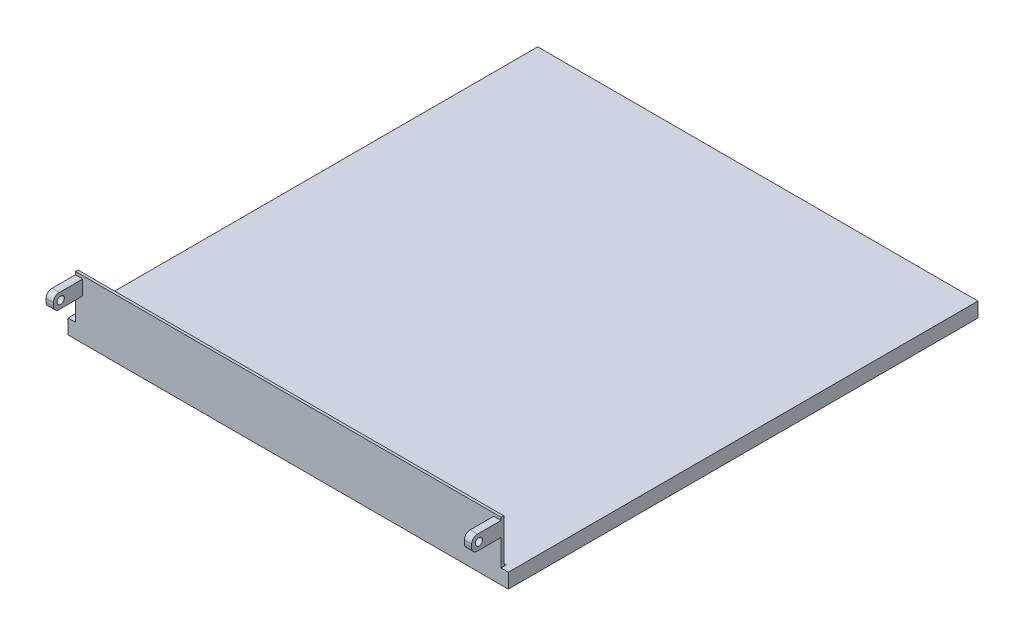
ISO-10303-21;
HEADER;
FILE_DESCRIPTION(('STEP AP214'),'2;1');
FILE_NAME('part.step','',(''),(''),'','','');
FILE_SCHEMA(('AUTOMOTIVE_DESIGN { 1 0 10303 214 1 1 1 1 }'));
ENDSEC;
DATA;
#1=APPLICATION_CONTEXT('core data for automotive mechanical design processes');
#2=APPLICATION_PROTOCOL_DEFINITION('international standard','automotive_design',2000,#1);
#3=PRODUCT_CONTEXT('',#1,'mechanical');
#4=PRODUCT('Part','Part','',(#3));
#5=PRODUCT_RELATED_PRODUCT_CATEGORY('part','',(#4));
#6=PRODUCT_DEFINITION_FORMATION('','',#4);
#7=PRODUCT_DEFINITION_CONTEXT('part definition',#1,'design');
#8=PRODUCT_DEFINITION('design','',#6,#7);
#9=PRODUCT_DEFINITION_SHAPE('','',#8);
#10=(LENGTH_UNIT() NAMED_UNIT(*) SI_UNIT(.MILLI.,.METRE.));
#11=(NAMED_UNIT(*) PLANE_ANGLE_UNIT() SI_UNIT($,.RADIAN.));
#12=(NAMED_UNIT(*) SI_UNIT($,.STERADIAN.) SOLID_ANGLE_UNIT());
#13=UNCERTAINTY_MEASURE_WITH_UNIT(LENGTH_MEASURE(1.E-05),#10,'distance_accuracy_value','');
#14=(GEOMETRIC_REPRESENTATION_CONTEXT(3) GLOBAL_UNCERTAINTY_ASSIGNED_CONTEXT((#13)) GLOBAL_UNIT_ASSIGNED_CONTEXT((#10,
#11,#12)) REPRESENTATION_CONTEXT('',''));
#15=CARTESIAN_POINT('',(0.,0.,0.));
#16=DIRECTION('',(0.,0.,1.));
#17=DIRECTION('',(1.,0.,0.));
#18=AXIS2_PLACEMENT_3D('',#15,#16,#17);
#19=CARTESIAN_POINT('',(-184.15,22.86,203.2));
#20=DIRECTION('',(0.,-1.,0.));
#21=DIRECTION('',(0.,0.,-1.));
#22=AXIS2_PLACEMENT_3D('',#19,#20,#21);
#23=PLANE('',#22);
#24=DIRECTION('',(0.,0.,-1.));
#25=VECTOR('',#24,1.);
#26=CARTESIAN_POINT('',(184.15,22.86,203.2));
#27=LINE('',#26,#25);
#28=CARTESIAN_POINT('',(184.15,22.86,223.52));
#29=VERTEX_POINT('',#28);
#30=CARTESIAN_POINT('',(184.15,22.86,203.2));
#31=VERTEX_POINT('',#30);
#32=EDGE_CURVE('E367',#29,#31,#27,.T.);
#33=ORIENTED_EDGE('',*,*,#32,.F.);
#34=DIRECTION('',(1.,0.,0.));
#35=VECTOR('',#34,1.);
#36=CARTESIAN_POINT('',(-184.15,22.86,223.52));
#37=LINE('',#36,#35);
#38=CARTESIAN_POINT('',(177.8,22.86,223.52));
#39=VERTEX_POINT('',#38);
#40=EDGE_CURVE('E272',#29,#39,#37,.F.);
#41=ORIENTED_EDGE('',*,*,#40,.T.);
#42=DIRECTION('',(0.,0.,-1.));
#43=VECTOR('',#42,1.);
#44=CARTESIAN_POINT('',(177.8,22.86,203.2));
#45=LINE('',#44,#43);
#46=CARTESIAN_POINT('',(177.8,22.86,203.2));
#47=VERTEX_POINT('',#46);
#48=EDGE_CURVE('E352',#39,#47,#45,.T.);
#49=ORIENTED_EDGE('',*,*,#48,.T.);
#50=DIRECTION('',(1.,0.,0.));
#51=VECTOR('',#50,1.);
#52=CARTESIAN_POINT('',(-184.15,22.86,203.2));
#53=LINE('',#52,#51);
#54=EDGE_CURVE('E384',#47,#31,#53,.T.);
#55=ORIENTED_EDGE('',*,*,#54,.T.);
#56=EDGE_LOOP('',(#33,#41,#49,#55));
#57=FACE_BOUND('',#56,.T.);
#58=ADVANCED_FACE('F41',(#57),#23,.T.);
#59=CARTESIAN_POINT('',(-184.15,35.56,228.6));
#60=DIRECTION('',(0.,0.,1.));
#61=DIRECTION('',(1.,0.,0.));
#62=AXIS2_PLACEMENT_3D('',#59,#60,#61);
#63=PLANE('',#62);
#64=DIRECTION('',(0.,-1.,0.));
#65=VECTOR('',#64,1.);
#66=CARTESIAN_POINT('',(184.15,35.56,228.6));
#67=LINE('',#66,#65);
#68=CARTESIAN_POINT('',(184.15,30.48,228.6));
#69=VERTEX_POINT('',#68);
#70=CARTESIAN_POINT('',(184.15,27.94,228.6));
#71=VERTEX_POINT('',#70);
#72=EDGE_CURVE('E363',#69,#71,#67,.T.);
#73=ORIENTED_EDGE('',*,*,#72,.F.);
#74=DIRECTION('',(1.,0.,0.));
#75=VECTOR('',#74,1.);
#76=CARTESIAN_POINT('',(-184.15,30.48,228.6));
#77=LINE('',#76,#75);
#78=CARTESIAN_POINT('',(177.8,30.48,228.6));
#79=VERTEX_POINT('',#78);
#80=EDGE_CURVE('E263',#69,#79,#77,.F.);
#81=ORIENTED_EDGE('',*,*,#80,.T.);
#82=DIRECTION('',(0.,-1.,0.));
#83=VECTOR('',#82,1.);
#84=CARTESIAN_POINT('',(177.8,35.56,228.6));
#85=LINE('',#84,#83);
#86=CARTESIAN_POINT('',(177.8,27.94,228.6));
#87=VERTEX_POINT('',#86);
#88=EDGE_CURVE('E348',#79,#87,#85,.T.);
#89=ORIENTED_EDGE('',*,*,#88,.T.);
#90=DIRECTION('',(1.,0.,0.));
#91=VECTOR('',#90,1.);
#92=CARTESIAN_POINT('',(-184.15,27.94,228.6));
#93=LINE('',#92,#91);
#94=EDGE_CURVE('E259',#87,#71,#93,.T.);
#95=ORIENTED_EDGE('',*,*,#94,.T.);
#96=EDGE_LOOP('',(#73,#81,#89,#95));
#97=FACE_BOUND('',#96,.T.);
#98=ADVANCED_FACE('F443',(#97),#63,.T.);
#99=CARTESIAN_POINT('',(-184.15,35.56,203.2));
#100=DIRECTION('',(0.,1.,0.));
#101=DIRECTION('',(0.,0.,1.));
#102=AXIS2_PLACEMENT_3D('',#99,#100,#101);
#103=PLANE('',#102);
#104=DIRECTION('',(0.,0.,1.));
#105=VECTOR('',#104,1.);
#106=CARTESIAN_POINT('',(177.8,35.56,203.2));
#107=LINE('',#106,#105);
#108=CARTESIAN_POINT('',(177.8,35.56,203.2));
#109=VERTEX_POINT('',#108);
#110=CARTESIAN_POINT('',(177.8,35.56,223.52));
#111=VERTEX_POINT('',#110);
#112=EDGE_CURVE('E344',#109,#111,#107,.T.);
#113=ORIENTED_EDGE('',*,*,#112,.T.);
#114=DIRECTION('',(1.,0.,0.));
#115=VECTOR('',#114,1.);
#116=CARTESIAN_POINT('',(-184.15,35.56,223.52));
#117=LINE('',#116,#115);
#118=CARTESIAN_POINT('',(184.15,35.56,223.52));
#119=VERTEX_POINT('',#118);
#120=EDGE_CURVE('E249',#111,#119,#117,.T.);
#121=ORIENTED_EDGE('',*,*,#120,.T.);
#122=DIRECTION('',(0.,0.,1.));
#123=VECTOR('',#122,1.);
#124=CARTESIAN_POINT('',(184.15,35.56,203.2));
#125=LINE('',#124,#123);
#126=CARTESIAN_POINT('',(184.15,35.56,203.2));
#127=VERTEX_POINT('',#126);
#128=EDGE_CURVE('E359',#127,#119,#125,.T.);
#129=ORIENTED_EDGE('',*,*,#128,.F.);
#130=DIRECTION('',(1.,0.,0.));
#131=VECTOR('',#130,1.);
#132=CARTESIAN_POINT('',(-184.15,35.56,203.2));
#133=LINE('',#132,#131);
#134=EDGE_CURVE('E380',#109,#127,#133,.T.);
#135=ORIENTED_EDGE('',*,*,#134,.F.);
#136=EDGE_LOOP('',(#113,#121,#129,#135));
#137=FACE_BOUND('',#136,.T.);
#138=ADVANCED_FACE('F450',(#137),#103,.T.);
#139=CARTESIAN_POINT('',(-184.15,29.21,222.25));
#140=DIRECTION('',(1.,0.,0.));
#141=DIRECTION('',(0.,0.,-1.));
#142=AXIS2_PLACEMENT_3D('',#139,#140,#141);
#143=CYLINDRICAL_SURFACE('',#142,3.175);
#144=CARTESIAN_POINT('',(184.15,29.21,222.25));
#145=DIRECTION('',(1.,0.,0.));
#146=DIRECTION('',(0.,0.,-1.));
#147=AXIS2_PLACEMENT_3D('',#144,#145,#146);
#148=CIRCLE('',#147,3.175);
#149=CARTESIAN_POINT('',(184.15,29.21,219.075));
#150=VERTEX_POINT('',#149);
#151=EDGE_CURVE('E355',#150,#150,#148,.T.);
#152=ORIENTED_EDGE('',*,*,#151,.T.);
#153=EDGE_LOOP('',(#152));
#154=FACE_BOUND('',#153,.T.);
#155=CARTESIAN_POINT('',(177.8,29.21,222.25));
#156=DIRECTION('',(1.,0.,0.));
#157=DIRECTION('',(0.,0.,-1.));
#158=AXIS2_PLACEMENT_3D('',#155,#156,#157);
#159=CIRCLE('',#158,3.175);
#160=CARTESIAN_POINT('',(177.8,29.21,219.075));
#161=VERTEX_POINT('',#160);
#162=EDGE_CURVE('E329',#161,#161,#159,.T.);
#163=ORIENTED_EDGE('',*,*,#162,.F.);
#164=EDGE_LOOP('',(#163));
#165=FACE_BOUND('',#164,.T.);
#166=ADVANCED_FACE('F421',(#154,#165),#143,.F.);
#167=CARTESIAN_POINT('',(-190.5,37.9451945625871,-1.72631976948593));
#168=DIRECTION('',(1.,0.,0.));
#169=DIRECTION('',(0.,0.,-1.));
#170=AXIS2_PLACEMENT_3D('',#167,#168,#169);
#171=PLANE('',#170);
#172=DIRECTION('',(0.,-1.,0.));
#173=VECTOR('',#172,1.);
#174=CARTESIAN_POINT('',(-190.5,0.,203.2));
#175=LINE('',#174,#173);
#176=CARTESIAN_POINT('',(-190.5,0.,203.2));
#177=VERTEX_POINT('',#176);
#178=CARTESIAN_POINT('',(-190.5,-12.7,203.2));
#179=VERTEX_POINT('',#178);
#180=EDGE_CURVE('E206',#177,#179,#175,.T.);
#181=ORIENTED_EDGE('',*,*,#180,.F.);
#182=DIRECTION('',(0.,0.,1.));
#183=VECTOR('',#182,1.);
#184=CARTESIAN_POINT('',(-190.5,0.,-203.2));
#185=LINE('',#184,#183);
#186=CARTESIAN_POINT('',(-190.5,0.,-203.2));
#187=VERTEX_POINT('',#186);
#188=EDGE_CURVE('E188',#187,#177,#185,.T.);
#189=ORIENTED_EDGE('',*,*,#188,.F.);
#190=DIRECTION('',(0.,-1.,0.));
#191=VECTOR('',#190,1.);
#192=CARTESIAN_POINT('',(-190.5,0.,-203.2));
#193=LINE('',#192,#191);
#194=CARTESIAN_POINT('',(-190.5,-12.7,-203.2));
#195=VERTEX_POINT('',#194);
#196=EDGE_CURVE('E204',#187,#195,#193,.T.);
#197=ORIENTED_EDGE('',*,*,#196,.T.);
#198=DIRECTION('',(0.,0.,1.));
#199=VECTOR('',#198,1.);
#200=CARTESIAN_POINT('',(-190.5,-12.7,-584.411607903012));
#201=LINE('',#200,#199);
#202=EDGE_CURVE('E214',#195,#179,#201,.T.);
#203=ORIENTED_EDGE('',*,*,#202,.T.);
#204=EDGE_LOOP('',(#181,#189,#197,#203));
#205=FACE_BOUND('',#204,.T.);
#206=ADVANCED_FACE('F202',(#205),#171,.F.);
#207=CARTESIAN_POINT('',(190.5,37.9451945625871,-1.72631976948593));
#208=DIRECTION('',(1.,0.,0.));
#209=DIRECTION('',(0.,0.,-1.));
#210=AXIS2_PLACEMENT_3D('',#207,#208,#209);
#211=PLANE('',#210);
#212=DIRECTION('',(0.,0.,1.));
#213=VECTOR('',#212,1.);
#214=CARTESIAN_POINT('',(190.5,0.,-203.2));
#215=LINE('',#214,#213);
#216=CARTESIAN_POINT('',(190.5,0.,-203.2));
#217=VERTEX_POINT('',#216);
#218=CARTESIAN_POINT('',(190.5,0.,203.2));
#219=VERTEX_POINT('',#218);
#220=EDGE_CURVE('E191',#217,#219,#215,.T.);
#221=ORIENTED_EDGE('',*,*,#220,.T.);
#222=DIRECTION('',(0.,-1.,0.));
#223=VECTOR('',#222,1.);
#224=CARTESIAN_POINT('',(190.5,0.,203.2));
#225=LINE('',#224,#223);
#226=CARTESIAN_POINT('',(190.5,-12.7,203.2));
#227=VERTEX_POINT('',#226);
#228=EDGE_CURVE('E220',#219,#227,#225,.T.);
#229=ORIENTED_EDGE('',*,*,#228,.T.);
#230=DIRECTION('',(0.,0.,1.));
#231=VECTOR('',#230,1.);
#232=CARTESIAN_POINT('',(190.5,-12.7,-584.411607903012));
#233=LINE('',#232,#231);
#234=CARTESIAN_POINT('',(190.5,-12.7,-203.2));
#235=VERTEX_POINT('',#234);
#236=EDGE_CURVE('E222',#235,#227,#233,.T.);
#237=ORIENTED_EDGE('',*,*,#236,.F.);
#238=DIRECTION('',(0.,1.,0.));
#239=VECTOR('',#238,1.);
#240=CARTESIAN_POINT('',(190.5,0.,-203.2));
#241=LINE('',#240,#239);
#242=EDGE_CURVE('E215',#235,#217,#241,.T.);
#243=ORIENTED_EDGE('',*,*,#242,.T.);
#244=EDGE_LOOP('',(#221,#229,#237,#243));
#245=FACE_BOUND('',#244,.T.);
#246=ADVANCED_FACE('F411',(#245),#211,.T.);
#247=CARTESIAN_POINT('',(0.,0.,200.66));
#248=DIRECTION('',(0.,0.,-1.));
#249=DIRECTION('',(-1.,0.,0.));
#250=AXIS2_PLACEMENT_3D('',#247,#248,#249);
#251=PLANE('',#250);
#252=DIRECTION('',(0.,-1.,0.));
#253=VECTOR('',#252,1.);
#254=CARTESIAN_POINT('',(-184.15,0.,200.66));
#255=LINE('',#254,#253);
#256=CARTESIAN_POINT('',(-184.15,37.7981647654384,200.66));
#257=VERTEX_POINT('',#256);
#258=CARTESIAN_POINT('',(-184.15,2.54,200.66));
#259=VERTEX_POINT('',#258);
#260=EDGE_CURVE('E560',#257,#259,#255,.T.);
#261=ORIENTED_EDGE('',*,*,#260,.F.);
#262=DIRECTION('',(-1.,0.,0.));
#263=VECTOR('',#262,1.);
#264=CARTESIAN_POINT('',(304.8,37.7981647654384,200.66));
#265=LINE('',#264,#263);
#266=CARTESIAN_POINT('',(184.15,37.7981647654384,200.66));
#267=VERTEX_POINT('',#266);
#268=EDGE_CURVE('E245',#257,#267,#265,.F.);
#269=ORIENTED_EDGE('',*,*,#268,.T.);
#270=DIRECTION('',(0.,1.,0.));
#271=VECTOR('',#270,1.);
#272=CARTESIAN_POINT('',(184.15,0.,200.66));
#273=LINE('',#272,#271);
#274=CARTESIAN_POINT('',(184.15,2.54,200.66));
#275=VERTEX_POINT('',#274);
#276=EDGE_CURVE('E59',#275,#267,#273,.T.);
#277=ORIENTED_EDGE('',*,*,#276,.F.);
#278=DIRECTION('',(1.,0.,0.));
#279=VECTOR('',#278,1.);
#280=CARTESIAN_POINT('',(-185.42,2.54,200.66));
#281=LINE('',#280,#279);
#282=EDGE_CURVE('E241',#275,#259,#281,.F.);
#283=ORIENTED_EDGE('',*,*,#282,.T.);
#284=EDGE_LOOP('',(#261,#269,#277,#283));
#285=FACE_BOUND('',#284,.T.);
#286=ADVANCED_FACE('F408',(#285),#251,.T.);
#287=CARTESIAN_POINT('',(190.5,-12.7,-203.2));
#288=DIRECTION('',(0.,0.,-1.));
#289=DIRECTION('',(-1.,0.,0.));
#290=AXIS2_PLACEMENT_3D('',#287,#288,#289);
#291=PLANE('',#290);
#292=DIRECTION('',(-1.,0.,0.));
#293=VECTOR('',#292,1.);
#294=CARTESIAN_POINT('',(190.5,0.,-203.2));
#295=LINE('',#294,#293);
#296=EDGE_CURVE('E45',#217,#187,#295,.T.);
#297=ORIENTED_EDGE('',*,*,#296,.F.);
#298=ORIENTED_EDGE('',*,*,#242,.F.);
#299=DIRECTION('',(1.,0.,0.));
#300=VECTOR('',#299,1.);
#301=CARTESIAN_POINT('',(-190.5,-12.7,-203.2));
#302=LINE('',#301,#300);
#303=EDGE_CURVE('E212',#195,#235,#302,.T.);
#304=ORIENTED_EDGE('',*,*,#303,.F.);
#305=ORIENTED_EDGE('',*,*,#196,.F.);
#306=EDGE_LOOP('',(#297,#298,#304,#305));
#307=FACE_BOUND('',#306,.T.);
#308=ADVANCED_FACE('F211',(#307),#291,.T.);
#309=CARTESIAN_POINT('',(190.5,-12.7,203.2));
#310=DIRECTION('',(0.,0.,1.));
#311=DIRECTION('',(1.,0.,0.));
#312=AXIS2_PLACEMENT_3D('',#309,#310,#311);
#313=PLANE('',#312);
#314=DIRECTION('',(0.,1.,0.));
#315=VECTOR('',#314,1.);
#316=CARTESIAN_POINT('',(-184.15,-12.7,203.2));
#317=LINE('',#316,#315);
#318=CARTESIAN_POINT('',(-184.15,35.56,203.2));
#319=VERTEX_POINT('',#318);
#320=CARTESIAN_POINT('',(-184.15,38.1,203.2));
#321=VERTEX_POINT('',#320);
#322=EDGE_CURVE('E67',#319,#321,#317,.T.);
#323=ORIENTED_EDGE('',*,*,#322,.F.);
#324=CARTESIAN_POINT('',(-177.8,35.56,203.2));
#325=VERTEX_POINT('',#324);
#326=EDGE_CURVE('E385',#319,#325,#133,.T.);
#327=ORIENTED_EDGE('',*,*,#326,.T.);
#328=DIRECTION('',(0.,1.,0.));
#329=VECTOR('',#328,1.);
#330=CARTESIAN_POINT('',(-177.8,35.56,203.2));
#331=LINE('',#330,#329);
#332=CARTESIAN_POINT('',(-177.8,22.86,203.2));
#333=VERTEX_POINT('',#332);
#334=EDGE_CURVE('E537',#333,#325,#331,.T.);
#335=ORIENTED_EDGE('',*,*,#334,.F.);
#336=CARTESIAN_POINT('',(-184.15,22.86,203.2));
#337=VERTEX_POINT('',#336);
#338=EDGE_CURVE('E327',#337,#333,#53,.T.);
#339=ORIENTED_EDGE('',*,*,#338,.F.);
#340=CARTESIAN_POINT('',(-184.15,0.,203.2));
#341=VERTEX_POINT('',#340);
#342=EDGE_CURVE('E556',#341,#337,#317,.T.);
#343=ORIENTED_EDGE('',*,*,#342,.F.);
#344=DIRECTION('',(1.,0.,0.));
#345=VECTOR('',#344,1.);
#346=CARTESIAN_POINT('',(190.5,0.,203.2));
#347=LINE('',#346,#345);
#348=EDGE_CURVE('E538',#177,#341,#347,.T.);
#349=ORIENTED_EDGE('',*,*,#348,.F.);
#350=ORIENTED_EDGE('',*,*,#180,.T.);
#351=DIRECTION('',(1.,0.,0.));
#352=VECTOR('',#351,1.);
#353=CARTESIAN_POINT('',(-190.5,-12.7,203.2));
#354=LINE('',#353,#352);
#355=EDGE_CURVE('E383',#179,#227,#354,.T.);
#356=ORIENTED_EDGE('',*,*,#355,.T.);
#357=ORIENTED_EDGE('',*,*,#228,.F.);
#358=DIRECTION('',(1.,0.,0.));
#359=VECTOR('',#358,1.);
#360=CARTESIAN_POINT('',(190.5,0.,203.2));
#361=LINE('',#360,#359);
#362=CARTESIAN_POINT('',(184.15,0.,203.2));
#363=VERTEX_POINT('',#362);
#364=EDGE_CURVE('E544',#363,#219,#361,.T.);
#365=ORIENTED_EDGE('',*,*,#364,.F.);
#366=DIRECTION('',(0.,-1.,0.));
#367=VECTOR('',#366,1.);
#368=CARTESIAN_POINT('',(184.15,-12.7,203.2));
#369=LINE('',#368,#367);
#370=EDGE_CURVE('E566',#31,#363,#369,.T.);
#371=ORIENTED_EDGE('',*,*,#370,.F.);
#372=ORIENTED_EDGE('',*,*,#54,.F.);
#373=DIRECTION('',(0.,1.,0.));
#374=VECTOR('',#373,1.);
#375=CARTESIAN_POINT('',(177.8,35.56,203.2));
#376=LINE('',#375,#374);
#377=EDGE_CURVE('E335',#47,#109,#376,.T.);
#378=ORIENTED_EDGE('',*,*,#377,.T.);
#379=ORIENTED_EDGE('',*,*,#134,.T.);
#380=CARTESIAN_POINT('',(184.15,38.1,203.2));
#381=VERTEX_POINT('',#380);
#382=EDGE_CURVE('E514',#381,#127,#369,.T.);
#383=ORIENTED_EDGE('',*,*,#382,.F.);
#384=DIRECTION('',(1.,0.,0.));
#385=VECTOR('',#384,1.);
#386=CARTESIAN_POINT('',(-190.5,38.1,203.2));
#387=LINE('',#386,#385);
#388=EDGE_CURVE('E198',#321,#381,#387,.T.);
#389=ORIENTED_EDGE('',*,*,#388,.F.);
#390=EDGE_LOOP('',(#323,#327,#335,#339,#343,#349,#350,#356,#357,#365,#371,#372,#378,#379,#383,#389));
#391=FACE_BOUND('',#390,.T.);
#392=ADVANCED_FACE('F415',(#391),#313,.T.);
#393=CARTESIAN_POINT('',(185.42,0.,203.2));
#394=DIRECTION('',(0.,1.,0.));
#395=DIRECTION('',(0.,0.,1.));
#396=AXIS2_PLACEMENT_3D('',#393,#394,#395);
#397=PLANE('',#396);
#398=ORIENTED_EDGE('',*,*,#296,.T.);
#399=ORIENTED_EDGE('',*,*,#188,.T.);
#400=ORIENTED_EDGE('',*,*,#348,.T.);
#401=DIRECTION('',(0.,0.,1.));
#402=VECTOR('',#401,1.);
#403=CARTESIAN_POINT('',(-184.15,0.,-203.2));
#404=LINE('',#403,#402);
#405=CARTESIAN_POINT('',(-184.15,0.,198.12));
#406=VERTEX_POINT('',#405);
#407=EDGE_CURVE('E208',#406,#341,#404,.T.);
#408=ORIENTED_EDGE('',*,*,#407,.F.);
#409=DIRECTION('',(1.,0.,0.));
#410=VECTOR('',#409,1.);
#411=CARTESIAN_POINT('',(185.42,0.,198.12));
#412=LINE('',#411,#410);
#413=CARTESIAN_POINT('',(184.15,0.,198.12));
#414=VERTEX_POINT('',#413);
#415=EDGE_CURVE('E197',#406,#414,#412,.T.);
#416=ORIENTED_EDGE('',*,*,#415,.T.);
#417=DIRECTION('',(0.,0.,1.));
#418=VECTOR('',#417,1.);
#419=CARTESIAN_POINT('',(184.15,0.,-203.2));
#420=LINE('',#419,#418);
#421=EDGE_CURVE('E209',#414,#363,#420,.T.);
#422=ORIENTED_EDGE('',*,*,#421,.T.);
#423=ORIENTED_EDGE('',*,*,#364,.T.);
#424=ORIENTED_EDGE('',*,*,#220,.F.);
#425=EDGE_LOOP('',(#398,#399,#400,#408,#416,#422,#423,#424));
#426=FACE_BOUND('',#425,.T.);
#427=ADVANCED_FACE('F187',(#426),#397,.T.);
#428=CARTESIAN_POINT('',(185.42,2.54,198.12));
#429=DIRECTION('',(-1.,0.,0.));
#430=DIRECTION('',(0.,0.,1.));
#431=AXIS2_PLACEMENT_3D('',#428,#429,#430);
#432=CYLINDRICAL_SURFACE('',#431,2.54);
#433=ORIENTED_EDGE('',*,*,#415,.F.);
#434=CARTESIAN_POINT('',(-184.15,2.54,198.12));
#435=DIRECTION('',(1.,0.,0.));
#436=DIRECTION('',(0.,0.,-1.));
#437=AXIS2_PLACEMENT_3D('',#434,#435,#436);
#438=CIRCLE('',#437,2.54);
#439=EDGE_CURVE('E567',#406,#259,#438,.F.);
#440=ORIENTED_EDGE('',*,*,#439,.T.);
#441=ORIENTED_EDGE('',*,*,#282,.F.);
#442=CARTESIAN_POINT('',(184.15,2.54,198.12));
#443=DIRECTION('',(-1.,0.,0.));
#444=DIRECTION('',(0.,0.,1.));
#445=AXIS2_PLACEMENT_3D('',#442,#443,#444);
#446=CIRCLE('',#445,2.54);
#447=EDGE_CURVE('E591',#275,#414,#446,.F.);
#448=ORIENTED_EDGE('',*,*,#447,.T.);
#449=EDGE_LOOP('',(#433,#440,#441,#448));
#450=FACE_BOUND('',#449,.T.);
#451=ADVANCED_FACE('F406',(#450),#432,.F.);
#452=CARTESIAN_POINT('',(-190.5,-12.7,-584.411607903012));
#453=DIRECTION('',(0.,-1.,0.));
#454=DIRECTION('',(0.,0.,-1.));
#455=AXIS2_PLACEMENT_3D('',#452,#453,#454);
#456=PLANE('',#455);
#457=ORIENTED_EDGE('',*,*,#303,.T.);
#458=ORIENTED_EDGE('',*,*,#236,.T.);
#459=ORIENTED_EDGE('',*,*,#355,.F.);
#460=ORIENTED_EDGE('',*,*,#202,.F.);
#461=EDGE_LOOP('',(#457,#458,#459,#460));
#462=FACE_BOUND('',#461,.T.);
#463=ADVANCED_FACE('F400',(#462),#456,.T.);
#464=CARTESIAN_POINT('',(304.8,38.1,203.2));
#465=CARTESIAN_POINT('',(304.8,17.6919284111724,32.0595959419028));
#466=CARTESIAN_POINT('',(304.8,16.2471407884915,-140.496349929878));
#467=B_SPLINE_CURVE_WITH_KNOTS('',2,(#464,#465,#466),.UNSPECIFIED.,.F.,.F.,(3,3),(0.,1.),.UNSPECIFIED.);
#468=DIRECTION('',(-1.,0.,0.));
#469=VECTOR('',#468,1.);
#470=SURFACE_OF_LINEAR_EXTRUSION('',#467,#469);
#471=CARTESIAN_POINT('',(-184.15,38.1,203.2));
#472=CARTESIAN_POINT('',(-184.15,17.6919284111724,32.0595959419028));
#473=CARTESIAN_POINT('',(-184.15,16.2471407884915,-140.496349929878));
#474=B_SPLINE_CURVE_WITH_KNOTS('',2,(#471,#472,#473),.UNSPECIFIED.,.F.,.F.,(3,3),(0.,1.),.UNSPECIFIED.);
#475=EDGE_CURVE('E554',#321,#257,#474,.T.);
#476=ORIENTED_EDGE('',*,*,#475,.F.);
#477=ORIENTED_EDGE('',*,*,#388,.T.);
#478=CARTESIAN_POINT('',(184.15,38.1,203.2));
#479=CARTESIAN_POINT('',(184.15,17.6919284111724,32.0595959419028));
#480=CARTESIAN_POINT('',(184.15,16.2471407884915,-140.496349929878));
#481=B_SPLINE_CURVE_WITH_KNOTS('',2,(#478,#479,#480),.UNSPECIFIED.,.F.,.F.,(3,3),(0.,1.),.UNSPECIFIED.);
#482=EDGE_CURVE('E572',#267,#381,#481,.F.);
#483=ORIENTED_EDGE('',*,*,#482,.F.);
#484=ORIENTED_EDGE('',*,*,#268,.F.);
#485=EDGE_LOOP('',(#476,#477,#483,#484));
#486=FACE_BOUND('',#485,.T.);
#487=ADVANCED_FACE('F396',(#486),#470,.T.);
#488=DIRECTION('',(0.,0.,-1.));
#489=VECTOR('',#488,1.);
#490=CARTESIAN_POINT('',(-177.8,22.86,203.2));
#491=LINE('',#490,#489);
#492=CARTESIAN_POINT('',(-177.8,22.86,223.52));
#493=VERTEX_POINT('',#492);
#494=EDGE_CURVE('E320',#493,#333,#491,.T.);
#495=ORIENTED_EDGE('',*,*,#494,.F.);
#496=DIRECTION('',(1.,0.,0.));
#497=VECTOR('',#496,1.);
#498=CARTESIAN_POINT('',(-184.15,22.86,223.52));
#499=LINE('',#498,#497);
#500=CARTESIAN_POINT('',(-184.15,22.86,223.52));
#501=VERTEX_POINT('',#500);
#502=EDGE_CURVE('E288',#493,#501,#499,.F.);
#503=ORIENTED_EDGE('',*,*,#502,.T.);
#504=DIRECTION('',(0.,0.,-1.));
#505=VECTOR('',#504,1.);
#506=CARTESIAN_POINT('',(-184.15,22.86,203.2));
#507=LINE('',#506,#505);
#508=EDGE_CURVE('E304',#501,#337,#507,.T.);
#509=ORIENTED_EDGE('',*,*,#508,.T.);
#510=ORIENTED_EDGE('',*,*,#338,.T.);
#511=EDGE_LOOP('',(#495,#503,#509,#510));
#512=FACE_BOUND('',#511,.T.);
#513=ADVANCED_FACE('F325',(#512),#23,.T.);
#514=DIRECTION('',(0.,-1.,0.));
#515=VECTOR('',#514,1.);
#516=CARTESIAN_POINT('',(-184.15,35.56,228.6));
#517=LINE('',#516,#515);
#518=CARTESIAN_POINT('',(-184.15,30.48,228.6));
#519=VERTEX_POINT('',#518);
#520=CARTESIAN_POINT('',(-184.15,27.94,228.6));
#521=VERTEX_POINT('',#520);
#522=EDGE_CURVE('E301',#519,#521,#517,.T.);
#523=ORIENTED_EDGE('',*,*,#522,.T.);
#524=DIRECTION('',(1.,0.,0.));
#525=VECTOR('',#524,1.);
#526=CARTESIAN_POINT('',(-184.15,27.94,228.6));
#527=LINE('',#526,#525);
#528=CARTESIAN_POINT('',(-177.8,27.94,228.6));
#529=VERTEX_POINT('',#528);
#530=EDGE_CURVE('E278',#521,#529,#527,.T.);
#531=ORIENTED_EDGE('',*,*,#530,.T.);
#532=DIRECTION('',(0.,-1.,0.));
#533=VECTOR('',#532,1.);
#534=CARTESIAN_POINT('',(-177.8,35.56,228.6));
#535=LINE('',#534,#533);
#536=CARTESIAN_POINT('',(-177.8,30.48,228.6));
#537=VERTEX_POINT('',#536);
#538=EDGE_CURVE('E322',#537,#529,#535,.T.);
#539=ORIENTED_EDGE('',*,*,#538,.F.);
#540=DIRECTION('',(1.,0.,0.));
#541=VECTOR('',#540,1.);
#542=CARTESIAN_POINT('',(-184.15,30.48,228.6));
#543=LINE('',#542,#541);
#544=EDGE_CURVE('E275',#537,#519,#543,.F.);
#545=ORIENTED_EDGE('',*,*,#544,.T.);
#546=EDGE_LOOP('',(#523,#531,#539,#545));
#547=FACE_BOUND('',#546,.T.);
#548=ADVANCED_FACE('F309',(#547),#63,.T.);
#549=DIRECTION('',(0.,0.,1.));
#550=VECTOR('',#549,1.);
#551=CARTESIAN_POINT('',(-184.15,35.56,203.2));
#552=LINE('',#551,#550);
#553=CARTESIAN_POINT('',(-184.15,35.56,223.52));
#554=VERTEX_POINT('',#553);
#555=EDGE_CURVE('E314',#319,#554,#552,.T.);
#556=ORIENTED_EDGE('',*,*,#555,.T.);
#557=DIRECTION('',(1.,0.,0.));
#558=VECTOR('',#557,1.);
#559=CARTESIAN_POINT('',(-184.15,35.56,223.52));
#560=LINE('',#559,#558);
#561=CARTESIAN_POINT('',(-177.8,35.56,223.52));
#562=VERTEX_POINT('',#561);
#563=EDGE_CURVE('E11',#554,#562,#560,.T.);
#564=ORIENTED_EDGE('',*,*,#563,.T.);
#565=DIRECTION('',(0.,0.,1.));
#566=VECTOR('',#565,1.);
#567=CARTESIAN_POINT('',(-177.8,35.56,203.2));
#568=LINE('',#567,#566);
#569=EDGE_CURVE('E337',#325,#562,#568,.T.);
#570=ORIENTED_EDGE('',*,*,#569,.F.);
#571=ORIENTED_EDGE('',*,*,#326,.F.);
#572=EDGE_LOOP('',(#556,#564,#570,#571));
#573=FACE_BOUND('',#572,.T.);
#574=ADVANCED_FACE('F402',(#573),#103,.T.);
#575=CARTESIAN_POINT('',(-184.15,0.,0.));
#576=DIRECTION('',(-1.,0.,0.));
#577=DIRECTION('',(0.,0.,1.));
#578=AXIS2_PLACEMENT_3D('',#575,#576,#577);
#579=PLANE('',#578);
#580=CARTESIAN_POINT('',(-184.15,29.21,222.25));
#581=DIRECTION('',(1.,0.,0.));
#582=DIRECTION('',(0.,0.,-1.));
#583=AXIS2_PLACEMENT_3D('',#580,#581,#582);
#584=CIRCLE('',#583,3.175);
#585=CARTESIAN_POINT('',(-184.15,29.21,219.075));
#586=VERTEX_POINT('',#585);
#587=EDGE_CURVE('E371',#586,#586,#584,.T.);
#588=ORIENTED_EDGE('',*,*,#587,.T.);
#589=EDGE_LOOP('',(#588));
#590=FACE_BOUND('',#589,.T.);
#591=ORIENTED_EDGE('',*,*,#508,.F.);
#592=CARTESIAN_POINT('',(-184.15,27.94,223.52));
#593=DIRECTION('',(-1.,0.,0.));
#594=DIRECTION('',(0.,0.,1.));
#595=AXIS2_PLACEMENT_3D('',#592,#593,#594);
#596=CIRCLE('',#595,5.08);
#597=EDGE_CURVE('E52',#501,#521,#596,.T.);
#598=ORIENTED_EDGE('',*,*,#597,.T.);
#599=ORIENTED_EDGE('',*,*,#522,.F.);
#600=CARTESIAN_POINT('',(-184.15,30.48,223.52));
#601=DIRECTION('',(-1.,0.,0.));
#602=DIRECTION('',(0.,0.,1.));
#603=AXIS2_PLACEMENT_3D('',#600,#601,#602);
#604=CIRCLE('',#603,5.08);
#605=EDGE_CURVE('E291',#519,#554,#604,.T.);
#606=ORIENTED_EDGE('',*,*,#605,.T.);
#607=ORIENTED_EDGE('',*,*,#555,.F.);
#608=ORIENTED_EDGE('',*,*,#322,.T.);
#609=ORIENTED_EDGE('',*,*,#475,.T.);
#610=ORIENTED_EDGE('',*,*,#260,.T.);
#611=ORIENTED_EDGE('',*,*,#439,.F.);
#612=ORIENTED_EDGE('',*,*,#407,.T.);
#613=ORIENTED_EDGE('',*,*,#342,.T.);
#614=EDGE_LOOP('',(#591,#598,#599,#606,#607,#608,#609,#610,#611,#612,#613));
#615=FACE_BOUND('',#614,.T.);
#616=ADVANCED_FACE('F300',(#590,#615),#579,.T.);
#617=CARTESIAN_POINT('',(-177.8,29.21,222.25));
#618=DIRECTION('',(1.,0.,0.));
#619=DIRECTION('',(0.,0.,-1.));
#620=AXIS2_PLACEMENT_3D('',#617,#618,#619);
#621=CIRCLE('',#620,3.175);
#622=CARTESIAN_POINT('',(-177.8,29.21,219.075));
#623=VERTEX_POINT('',#622);
#624=EDGE_CURVE('E534',#623,#623,#621,.T.);
#625=ORIENTED_EDGE('',*,*,#624,.T.);
#626=EDGE_LOOP('',(#625));
#627=FACE_BOUND('',#626,.T.);
#628=ORIENTED_EDGE('',*,*,#587,.F.);
#629=EDGE_LOOP('',(#628));
#630=FACE_BOUND('',#629,.T.);
#631=ADVANCED_FACE('F466',(#627,#630),#143,.F.);
#632=CARTESIAN_POINT('',(184.15,0.,0.));
#633=DIRECTION('',(-1.,0.,0.));
#634=DIRECTION('',(0.,0.,1.));
#635=AXIS2_PLACEMENT_3D('',#632,#633,#634);
#636=PLANE('',#635);
#637=ORIENTED_EDGE('',*,*,#128,.T.);
#638=CARTESIAN_POINT('',(184.15,30.48,223.52));
#639=DIRECTION('',(-1.,0.,0.));
#640=DIRECTION('',(0.,0.,1.));
#641=AXIS2_PLACEMENT_3D('',#638,#639,#640);
#642=CIRCLE('',#641,5.08);
#643=EDGE_CURVE('E256',#119,#69,#642,.F.);
#644=ORIENTED_EDGE('',*,*,#643,.T.);
#645=ORIENTED_EDGE('',*,*,#72,.T.);
#646=CARTESIAN_POINT('',(184.15,27.94,223.52));
#647=DIRECTION('',(-1.,0.,0.));
#648=DIRECTION('',(0.,0.,1.));
#649=AXIS2_PLACEMENT_3D('',#646,#647,#648);
#650=CIRCLE('',#649,5.08);
#651=EDGE_CURVE('E253',#71,#29,#650,.F.);
#652=ORIENTED_EDGE('',*,*,#651,.T.);
#653=ORIENTED_EDGE('',*,*,#32,.T.);
#654=ORIENTED_EDGE('',*,*,#370,.T.);
#655=ORIENTED_EDGE('',*,*,#421,.F.);
#656=ORIENTED_EDGE('',*,*,#447,.F.);
#657=ORIENTED_EDGE('',*,*,#276,.T.);
#658=ORIENTED_EDGE('',*,*,#482,.T.);
#659=ORIENTED_EDGE('',*,*,#382,.T.);
#660=EDGE_LOOP('',(#637,#644,#645,#652,#653,#654,#655,#656,#657,#658,#659));
#661=FACE_BOUND('',#660,.T.);
#662=ORIENTED_EDGE('',*,*,#151,.F.);
#663=EDGE_LOOP('',(#662));
#664=FACE_BOUND('',#663,.T.);
#665=ADVANCED_FACE('F483',(#661,#664),#636,.F.);
#666=CARTESIAN_POINT('',(177.8,0.,0.));
#667=DIRECTION('',(-1.,0.,0.));
#668=DIRECTION('',(0.,0.,1.));
#669=AXIS2_PLACEMENT_3D('',#666,#667,#668);
#670=PLANE('',#669);
#671=ORIENTED_EDGE('',*,*,#88,.F.);
#672=CARTESIAN_POINT('',(177.8,30.48,223.52));
#673=DIRECTION('',(-1.,0.,0.));
#674=DIRECTION('',(0.,0.,1.));
#675=AXIS2_PLACEMENT_3D('',#672,#673,#674);
#676=CIRCLE('',#675,5.08);
#677=EDGE_CURVE('E269',#79,#111,#676,.T.);
#678=ORIENTED_EDGE('',*,*,#677,.T.);
#679=ORIENTED_EDGE('',*,*,#112,.F.);
#680=ORIENTED_EDGE('',*,*,#377,.F.);
#681=ORIENTED_EDGE('',*,*,#48,.F.);
#682=CARTESIAN_POINT('',(177.8,27.94,223.52));
#683=DIRECTION('',(-1.,0.,0.));
#684=DIRECTION('',(0.,0.,1.));
#685=AXIS2_PLACEMENT_3D('',#682,#683,#684);
#686=CIRCLE('',#685,5.08);
#687=EDGE_CURVE('E266',#39,#87,#686,.T.);
#688=ORIENTED_EDGE('',*,*,#687,.T.);
#689=EDGE_LOOP('',(#671,#678,#679,#680,#681,#688));
#690=FACE_BOUND('',#689,.T.);
#691=ORIENTED_EDGE('',*,*,#162,.T.);
#692=EDGE_LOOP('',(#691));
#693=FACE_BOUND('',#692,.T.);
#694=ADVANCED_FACE('F515',(#690,#693),#670,.T.);
#695=CARTESIAN_POINT('',(-177.8,0.,0.));
#696=DIRECTION('',(-1.,0.,0.));
#697=DIRECTION('',(0.,0.,1.));
#698=AXIS2_PLACEMENT_3D('',#695,#696,#697);
#699=PLANE('',#698);
#700=ORIENTED_EDGE('',*,*,#624,.F.);
#701=EDGE_LOOP('',(#700));
#702=FACE_BOUND('',#701,.T.);
#703=ORIENTED_EDGE('',*,*,#538,.T.);
#704=CARTESIAN_POINT('',(-177.8,27.94,223.52));
#705=DIRECTION('',(-1.,0.,0.));
#706=DIRECTION('',(0.,0.,1.));
#707=AXIS2_PLACEMENT_3D('',#704,#705,#706);
#708=CIRCLE('',#707,5.08);
#709=EDGE_CURVE('E285',#529,#493,#708,.F.);
#710=ORIENTED_EDGE('',*,*,#709,.T.);
#711=ORIENTED_EDGE('',*,*,#494,.T.);
#712=ORIENTED_EDGE('',*,*,#334,.T.);
#713=ORIENTED_EDGE('',*,*,#569,.T.);
#714=CARTESIAN_POINT('',(-177.8,30.48,223.52));
#715=DIRECTION('',(-1.,0.,0.));
#716=DIRECTION('',(0.,0.,1.));
#717=AXIS2_PLACEMENT_3D('',#714,#715,#716);
#718=CIRCLE('',#717,5.08);
#719=EDGE_CURVE('E282',#562,#537,#718,.F.);
#720=ORIENTED_EDGE('',*,*,#719,.T.);
#721=EDGE_LOOP('',(#703,#710,#711,#712,#713,#720));
#722=FACE_BOUND('',#721,.T.);
#723=ADVANCED_FACE('F319',(#702,#722),#699,.F.);
#724=CARTESIAN_POINT('',(-184.15,30.48,223.52));
#725=DIRECTION('',(1.,0.,0.));
#726=DIRECTION('',(0.,0.,-1.));
#727=AXIS2_PLACEMENT_3D('',#724,#725,#726);
#728=CYLINDRICAL_SURFACE('',#727,5.08);
#729=ORIENTED_EDGE('',*,*,#677,.F.);
#730=ORIENTED_EDGE('',*,*,#80,.F.);
#731=ORIENTED_EDGE('',*,*,#643,.F.);
#732=ORIENTED_EDGE('',*,*,#120,.F.);
#733=EDGE_LOOP('',(#729,#730,#731,#732));
#734=FACE_BOUND('',#733,.T.);
#735=ADVANCED_FACE('F430',(#734),#728,.T.);
#736=CARTESIAN_POINT('',(-184.15,27.94,223.52));
#737=DIRECTION('',(1.,0.,0.));
#738=DIRECTION('',(0.,0.,-1.));
#739=AXIS2_PLACEMENT_3D('',#736,#737,#738);
#740=CYLINDRICAL_SURFACE('',#739,5.08);
#741=ORIENTED_EDGE('',*,*,#687,.F.);
#742=ORIENTED_EDGE('',*,*,#40,.F.);
#743=ORIENTED_EDGE('',*,*,#651,.F.);
#744=ORIENTED_EDGE('',*,*,#94,.F.);
#745=EDGE_LOOP('',(#741,#742,#743,#744));
#746=FACE_BOUND('',#745,.T.);
#747=ADVANCED_FACE('F433',(#746),#740,.T.);
#748=CARTESIAN_POINT('',(-184.15,27.94,223.52));
#749=DIRECTION('',(1.,0.,0.));
#750=DIRECTION('',(0.,0.,-1.));
#751=AXIS2_PLACEMENT_3D('',#748,#749,#750);
#752=CYLINDRICAL_SURFACE('',#751,5.08);
#753=ORIENTED_EDGE('',*,*,#597,.F.);
#754=ORIENTED_EDGE('',*,*,#502,.F.);
#755=ORIENTED_EDGE('',*,*,#709,.F.);
#756=ORIENTED_EDGE('',*,*,#530,.F.);
#757=EDGE_LOOP('',(#753,#754,#755,#756));
#758=FACE_BOUND('',#757,.T.);
#759=ADVANCED_FACE('F316',(#758),#752,.T.);
#760=CARTESIAN_POINT('',(-184.15,30.48,223.52));
#761=DIRECTION('',(1.,0.,0.));
#762=DIRECTION('',(0.,0.,-1.));
#763=AXIS2_PLACEMENT_3D('',#760,#761,#762);
#764=CYLINDRICAL_SURFACE('',#763,5.08);
#765=ORIENTED_EDGE('',*,*,#605,.F.);
#766=ORIENTED_EDGE('',*,*,#544,.F.);
#767=ORIENTED_EDGE('',*,*,#719,.F.);
#768=ORIENTED_EDGE('',*,*,#563,.F.);
#769=EDGE_LOOP('',(#765,#766,#767,#768));
#770=FACE_BOUND('',#769,.T.);
#771=ADVANCED_FACE('F43',(#770),#764,.T.);
#772=CLOSED_SHELL('',(#58,#98,#138,#166,#206,#246,#286,#308,#392,#427,#451,#463,#487,#513,#548,
#574,#616,#631,#665,#694,#723,#735,#747,#759,#771));
#773=MANIFOLD_SOLID_BREP('B2',#772);
#774=ADVANCED_BREP_SHAPE_REPRESENTATION('',(#18,#773),#14);
#775=SHAPE_DEFINITION_REPRESENTATION(#9,#774);
ENDSEC;
END-ISO-10303-21;
